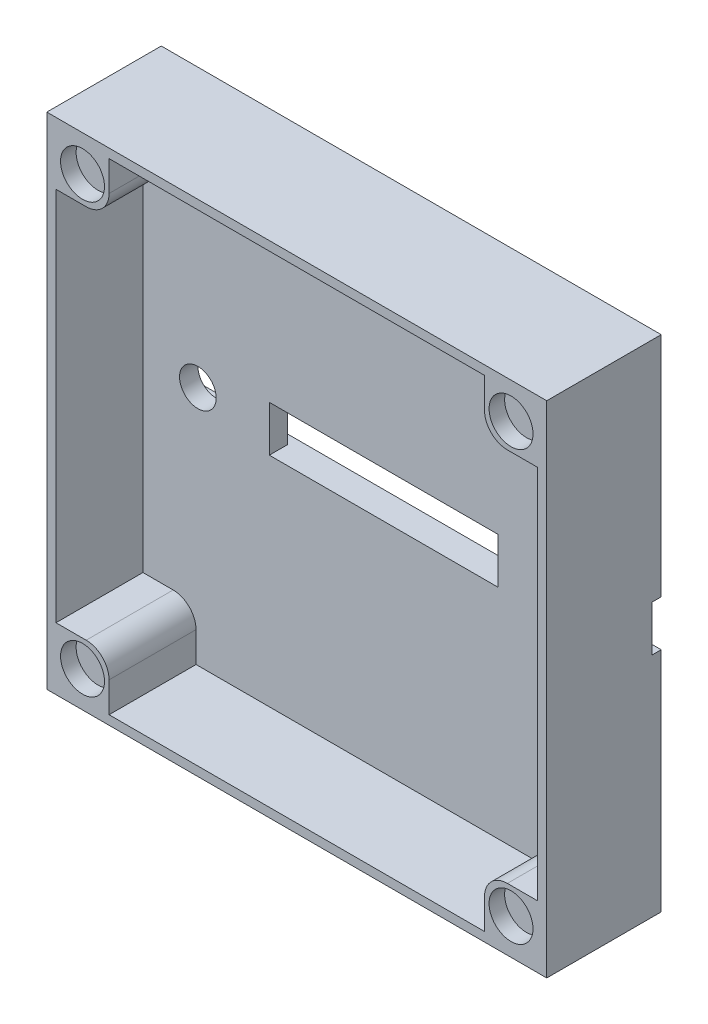
ISO-10303-21;
HEADER;
FILE_DESCRIPTION(('STEP AP214'),'2;1');
FILE_NAME('part.step','',(''),(''),'','','');
FILE_SCHEMA(('AUTOMOTIVE_DESIGN { 1 0 10303 214 1 1 1 1 }'));
ENDSEC;
DATA;
#1=APPLICATION_CONTEXT('core data for automotive mechanical design processes');
#2=APPLICATION_PROTOCOL_DEFINITION('international standard','automotive_design',2000,#1);
#3=PRODUCT_CONTEXT('',#1,'mechanical');
#4=PRODUCT('Part','Part','',(#3));
#5=PRODUCT_RELATED_PRODUCT_CATEGORY('part','',(#4));
#6=PRODUCT_DEFINITION_FORMATION('','',#4);
#7=PRODUCT_DEFINITION_CONTEXT('part definition',#1,'design');
#8=PRODUCT_DEFINITION('design','',#6,#7);
#9=PRODUCT_DEFINITION_SHAPE('','',#8);
#10=(LENGTH_UNIT() NAMED_UNIT(*) SI_UNIT(.MILLI.,.METRE.));
#11=(NAMED_UNIT(*) PLANE_ANGLE_UNIT() SI_UNIT($,.RADIAN.));
#12=(NAMED_UNIT(*) SI_UNIT($,.STERADIAN.) SOLID_ANGLE_UNIT());
#13=UNCERTAINTY_MEASURE_WITH_UNIT(LENGTH_MEASURE(1.E-05),#10,'distance_accuracy_value','');
#14=(GEOMETRIC_REPRESENTATION_CONTEXT(3) GLOBAL_UNCERTAINTY_ASSIGNED_CONTEXT((#13)) GLOBAL_UNIT_ASSIGNED_CONTEXT((#10,
#11,#12)) REPRESENTATION_CONTEXT('',''));
#15=CARTESIAN_POINT('',(0.,0.,0.));
#16=DIRECTION('',(0.,0.,1.));
#17=DIRECTION('',(1.,0.,0.));
#18=AXIS2_PLACEMENT_3D('',#15,#16,#17);
#19=CARTESIAN_POINT('',(0.,0.,3.));
#20=DIRECTION('',(0.,0.,1.));
#21=DIRECTION('',(1.,0.,0.));
#22=AXIS2_PLACEMENT_3D('',#19,#20,#21);
#23=PLANE('',#22);
#24=DIRECTION('',(0.,1.,0.));
#25=VECTOR('',#24,1.);
#26=CARTESIAN_POINT('',(-20.5,0.,3.));
#27=LINE('',#26,#25);
#28=CARTESIAN_POINT('',(-20.5,-26.3,3.));
#29=VERTEX_POINT('',#28);
#30=CARTESIAN_POINT('',(-20.5,-23.,3.));
#31=VERTEX_POINT('',#30);
#32=EDGE_CURVE('E265',#29,#31,#27,.T.);
#33=ORIENTED_EDGE('',*,*,#32,.F.);
#34=DIRECTION('',(1.,0.,0.));
#35=VECTOR('',#34,1.);
#36=CARTESIAN_POINT('',(-26.3,-26.3,3.));
#37=LINE('',#36,#35);
#38=CARTESIAN_POINT('',(20.5,-26.3,3.));
#39=VERTEX_POINT('',#38);
#40=EDGE_CURVE('E279',#29,#39,#37,.T.);
#41=ORIENTED_EDGE('',*,*,#40,.T.);
#42=DIRECTION('',(0.,-1.,0.));
#43=VECTOR('',#42,1.);
#44=CARTESIAN_POINT('',(20.5,0.,3.));
#45=LINE('',#44,#43);
#46=CARTESIAN_POINT('',(20.5,-23.,3.));
#47=VERTEX_POINT('',#46);
#48=EDGE_CURVE('E347',#47,#39,#45,.T.);
#49=ORIENTED_EDGE('',*,*,#48,.F.);
#50=CARTESIAN_POINT('',(23.,-23.,3.));
#51=DIRECTION('',(0.,0.,1.));
#52=DIRECTION('',(1.,0.,0.));
#53=AXIS2_PLACEMENT_3D('',#50,#51,#52);
#54=CIRCLE('',#53,2.5);
#55=CARTESIAN_POINT('',(23.,-20.5,3.));
#56=VERTEX_POINT('',#55);
#57=EDGE_CURVE('E318',#47,#56,#54,.F.);
#58=ORIENTED_EDGE('',*,*,#57,.T.);
#59=DIRECTION('',(-1.,0.,0.));
#60=VECTOR('',#59,1.);
#61=CARTESIAN_POINT('',(0.,-20.5,3.));
#62=LINE('',#61,#60);
#63=CARTESIAN_POINT('',(26.3,-20.5,3.));
#64=VERTEX_POINT('',#63);
#65=EDGE_CURVE('E352',#64,#56,#62,.T.);
#66=ORIENTED_EDGE('',*,*,#65,.F.);
#67=DIRECTION('',(0.,-1.,0.));
#68=VECTOR('',#67,1.);
#69=CARTESIAN_POINT('',(26.3,0.,3.));
#70=LINE('',#69,#68);
#71=CARTESIAN_POINT('',(26.3,20.5,3.));
#72=VERTEX_POINT('',#71);
#73=EDGE_CURVE('E416',#72,#64,#70,.T.);
#74=ORIENTED_EDGE('',*,*,#73,.F.);
#75=DIRECTION('',(1.,0.,0.));
#76=VECTOR('',#75,1.);
#77=CARTESIAN_POINT('',(0.,20.5,3.));
#78=LINE('',#77,#76);
#79=CARTESIAN_POINT('',(23.,20.5,3.));
#80=VERTEX_POINT('',#79);
#81=EDGE_CURVE('E377',#80,#72,#78,.T.);
#82=ORIENTED_EDGE('',*,*,#81,.F.);
#83=CARTESIAN_POINT('',(23.,23.,3.));
#84=DIRECTION('',(0.,0.,1.));
#85=DIRECTION('',(1.,0.,0.));
#86=AXIS2_PLACEMENT_3D('',#83,#84,#85);
#87=CIRCLE('',#86,2.5);
#88=CARTESIAN_POINT('',(20.5,23.,3.));
#89=VERTEX_POINT('',#88);
#90=EDGE_CURVE('E316',#80,#89,#87,.F.);
#91=ORIENTED_EDGE('',*,*,#90,.T.);
#92=DIRECTION('',(0.,-1.,0.));
#93=VECTOR('',#92,1.);
#94=CARTESIAN_POINT('',(20.5,0.,3.));
#95=LINE('',#94,#93);
#96=CARTESIAN_POINT('',(20.5,26.3,3.));
#97=VERTEX_POINT('',#96);
#98=EDGE_CURVE('E382',#97,#89,#95,.T.);
#99=ORIENTED_EDGE('',*,*,#98,.F.);
#100=DIRECTION('',(1.,0.,0.));
#101=VECTOR('',#100,1.);
#102=CARTESIAN_POINT('',(0.,26.3,3.));
#103=LINE('',#102,#101);
#104=CARTESIAN_POINT('',(-20.5,26.3,3.));
#105=VERTEX_POINT('',#104);
#106=EDGE_CURVE('E278',#105,#97,#103,.T.);
#107=ORIENTED_EDGE('',*,*,#106,.F.);
#108=DIRECTION('',(0.,1.,0.));
#109=VECTOR('',#108,1.);
#110=CARTESIAN_POINT('',(-20.5,0.,3.));
#111=LINE('',#110,#109);
#112=CARTESIAN_POINT('',(-20.5,23.,3.));
#113=VERTEX_POINT('',#112);
#114=EDGE_CURVE('E363',#113,#105,#111,.T.);
#115=ORIENTED_EDGE('',*,*,#114,.F.);
#116=CARTESIAN_POINT('',(-23.,23.,3.));
#117=DIRECTION('',(0.,0.,1.));
#118=DIRECTION('',(1.,0.,0.));
#119=AXIS2_PLACEMENT_3D('',#116,#117,#118);
#120=CIRCLE('',#119,2.5);
#121=CARTESIAN_POINT('',(-23.,20.5,3.));
#122=VERTEX_POINT('',#121);
#123=EDGE_CURVE('E12',#113,#122,#120,.F.);
#124=ORIENTED_EDGE('',*,*,#123,.T.);
#125=DIRECTION('',(1.,0.,0.));
#126=VECTOR('',#125,1.);
#127=CARTESIAN_POINT('',(0.,20.5,3.));
#128=LINE('',#127,#126);
#129=CARTESIAN_POINT('',(-26.3,20.5,3.));
#130=VERTEX_POINT('',#129);
#131=EDGE_CURVE('E367',#130,#122,#128,.T.);
#132=ORIENTED_EDGE('',*,*,#131,.F.);
#133=DIRECTION('',(0.,-1.,0.));
#134=VECTOR('',#133,1.);
#135=CARTESIAN_POINT('',(-26.3,0.,3.));
#136=LINE('',#135,#134);
#137=CARTESIAN_POINT('',(-26.3,-20.5,3.));
#138=VERTEX_POINT('',#137);
#139=EDGE_CURVE('E401',#130,#138,#136,.T.);
#140=ORIENTED_EDGE('',*,*,#139,.T.);
#141=DIRECTION('',(-1.,0.,0.));
#142=VECTOR('',#141,1.);
#143=CARTESIAN_POINT('',(0.,-20.5,3.));
#144=LINE('',#143,#142);
#145=CARTESIAN_POINT('',(-23.,-20.5,3.));
#146=VERTEX_POINT('',#145);
#147=EDGE_CURVE('E322',#146,#138,#144,.T.);
#148=ORIENTED_EDGE('',*,*,#147,.F.);
#149=CARTESIAN_POINT('',(-23.,-23.,3.));
#150=DIRECTION('',(0.,0.,1.));
#151=DIRECTION('',(1.,0.,0.));
#152=AXIS2_PLACEMENT_3D('',#149,#150,#151);
#153=CIRCLE('',#152,2.5);
#154=EDGE_CURVE('E79',#146,#31,#153,.F.);
#155=ORIENTED_EDGE('',*,*,#154,.T.);
#156=EDGE_LOOP('',(#33,#41,#49,#58,#66,#74,#82,#91,#99,#107,#115,#124,#132,#140,#148,#155));
#157=FACE_BOUND('',#156,.T.);
#158=CARTESIAN_POINT('',(20.3,0.,3.));
#159=DIRECTION('',(0.,0.,1.));
#160=DIRECTION('',(1.,0.,0.));
#161=AXIS2_PLACEMENT_3D('',#158,#159,#160);
#162=CIRCLE('',#161,2.);
#163=CARTESIAN_POINT('',(22.3,0.,3.));
#164=VERTEX_POINT('',#163);
#165=EDGE_CURVE('E394',#164,#164,#162,.T.);
#166=ORIENTED_EDGE('',*,*,#165,.F.);
#167=EDGE_LOOP('',(#166));
#168=FACE_BOUND('',#167,.T.);
#169=CARTESIAN_POINT('',(-20.3,0.,3.));
#170=DIRECTION('',(0.,0.,1.));
#171=DIRECTION('',(1.,0.,0.));
#172=AXIS2_PLACEMENT_3D('',#169,#170,#171);
#173=CIRCLE('',#172,2.);
#174=CARTESIAN_POINT('',(-18.3,0.,3.));
#175=VERTEX_POINT('',#174);
#176=EDGE_CURVE('E389',#175,#175,#173,.T.);
#177=ORIENTED_EDGE('',*,*,#176,.F.);
#178=EDGE_LOOP('',(#177));
#179=FACE_BOUND('',#178,.T.);
#180=DIRECTION('',(0.,1.,0.));
#181=VECTOR('',#180,1.);
#182=CARTESIAN_POINT('',(12.5,2.5,3.));
#183=LINE('',#182,#181);
#184=CARTESIAN_POINT('',(12.5,-2.5,3.));
#185=VERTEX_POINT('',#184);
#186=CARTESIAN_POINT('',(12.5,2.5,3.));
#187=VERTEX_POINT('',#186);
#188=EDGE_CURVE('E442',#185,#187,#183,.T.);
#189=ORIENTED_EDGE('',*,*,#188,.F.);
#190=DIRECTION('',(1.,0.,0.));
#191=VECTOR('',#190,1.);
#192=CARTESIAN_POINT('',(-12.5,-2.5,3.));
#193=LINE('',#192,#191);
#194=CARTESIAN_POINT('',(-12.5,-2.5,3.));
#195=VERTEX_POINT('',#194);
#196=EDGE_CURVE('E453',#195,#185,#193,.T.);
#197=ORIENTED_EDGE('',*,*,#196,.F.);
#198=DIRECTION('',(0.,-1.,0.));
#199=VECTOR('',#198,1.);
#200=CARTESIAN_POINT('',(-12.5,2.5,3.));
#201=LINE('',#200,#199);
#202=CARTESIAN_POINT('',(-12.5,2.5,3.));
#203=VERTEX_POINT('',#202);
#204=EDGE_CURVE('E460',#203,#195,#201,.T.);
#205=ORIENTED_EDGE('',*,*,#204,.F.);
#206=DIRECTION('',(-1.,0.,0.));
#207=VECTOR('',#206,1.);
#208=CARTESIAN_POINT('',(-12.5,2.5,3.));
#209=LINE('',#208,#207);
#210=EDGE_CURVE('E457',#187,#203,#209,.T.);
#211=ORIENTED_EDGE('',*,*,#210,.F.);
#212=EDGE_LOOP('',(#189,#197,#205,#211));
#213=FACE_BOUND('',#212,.T.);
#214=ADVANCED_FACE('F71',(#157,#168,#179,#213),#23,.T.);
#215=CARTESIAN_POINT('',(27.3,27.3,3.));
#216=DIRECTION('',(1.,0.,0.));
#217=DIRECTION('',(0.,1.,0.));
#218=AXIS2_PLACEMENT_3D('',#215,#216,#217);
#219=PLANE('',#218);
#220=DIRECTION('',(0.,0.,-1.));
#221=VECTOR('',#220,1.);
#222=CARTESIAN_POINT('',(27.3,27.3,3.));
#223=LINE('',#222,#221);
#224=CARTESIAN_POINT('',(27.3,27.3,12.5));
#225=VERTEX_POINT('',#224);
#226=CARTESIAN_POINT('',(27.3,27.3,0.));
#227=VERTEX_POINT('',#226);
#228=EDGE_CURVE('E486',#225,#227,#223,.T.);
#229=ORIENTED_EDGE('',*,*,#228,.F.);
#230=DIRECTION('',(0.,1.,0.));
#231=VECTOR('',#230,1.);
#232=CARTESIAN_POINT('',(27.3,0.,12.5));
#233=LINE('',#232,#231);
#234=CARTESIAN_POINT('',(27.3,-27.3,12.5));
#235=VERTEX_POINT('',#234);
#236=EDGE_CURVE('E406',#235,#225,#233,.T.);
#237=ORIENTED_EDGE('',*,*,#236,.F.);
#238=DIRECTION('',(0.,0.,-1.));
#239=VECTOR('',#238,1.);
#240=CARTESIAN_POINT('',(27.3,-27.3,3.));
#241=LINE('',#240,#239);
#242=CARTESIAN_POINT('',(27.3,-27.3,0.));
#243=VERTEX_POINT('',#242);
#244=EDGE_CURVE('E290',#235,#243,#241,.T.);
#245=ORIENTED_EDGE('',*,*,#244,.T.);
#246=DIRECTION('',(0.,-1.,0.));
#247=VECTOR('',#246,1.);
#248=CARTESIAN_POINT('',(27.3,27.3,0.));
#249=LINE('',#248,#247);
#250=CARTESIAN_POINT('',(27.3,-2.5,0.));
#251=VERTEX_POINT('',#250);
#252=EDGE_CURVE('E480',#251,#243,#249,.T.);
#253=ORIENTED_EDGE('',*,*,#252,.F.);
#254=DIRECTION('',(0.,0.,-1.));
#255=VECTOR('',#254,1.);
#256=CARTESIAN_POINT('',(27.3,-2.5,1.));
#257=LINE('',#256,#255);
#258=CARTESIAN_POINT('',(27.3,-2.5,1.));
#259=VERTEX_POINT('',#258);
#260=EDGE_CURVE('E435',#259,#251,#257,.T.);
#261=ORIENTED_EDGE('',*,*,#260,.F.);
#262=DIRECTION('',(0.,-1.,0.));
#263=VECTOR('',#262,1.);
#264=CARTESIAN_POINT('',(27.3,2.5,1.));
#265=LINE('',#264,#263);
#266=CARTESIAN_POINT('',(27.3,2.5,1.));
#267=VERTEX_POINT('',#266);
#268=EDGE_CURVE('E421',#267,#259,#265,.T.);
#269=ORIENTED_EDGE('',*,*,#268,.F.);
#270=DIRECTION('',(0.,0.,-1.));
#271=VECTOR('',#270,1.);
#272=CARTESIAN_POINT('',(27.3,2.5,1.));
#273=LINE('',#272,#271);
#274=CARTESIAN_POINT('',(27.3,2.5,0.));
#275=VERTEX_POINT('',#274);
#276=EDGE_CURVE('E439',#267,#275,#273,.T.);
#277=ORIENTED_EDGE('',*,*,#276,.T.);
#278=EDGE_CURVE('E481',#227,#275,#249,.T.);
#279=ORIENTED_EDGE('',*,*,#278,.F.);
#280=EDGE_LOOP('',(#229,#237,#245,#253,#261,#269,#277,#279));
#281=FACE_BOUND('',#280,.T.);
#282=ADVANCED_FACE('F511',(#281),#219,.T.);
#283=CARTESIAN_POINT('',(-27.3,27.3,3.));
#284=DIRECTION('',(1.,0.,0.));
#285=DIRECTION('',(0.,1.,0.));
#286=AXIS2_PLACEMENT_3D('',#283,#284,#285);
#287=PLANE('',#286);
#288=DIRECTION('',(0.,-1.,0.));
#289=VECTOR('',#288,1.);
#290=CARTESIAN_POINT('',(-27.3,27.3,0.));
#291=LINE('',#290,#289);
#292=CARTESIAN_POINT('',(-27.3,-2.5,0.));
#293=VERTEX_POINT('',#292);
#294=CARTESIAN_POINT('',(-27.3,-27.3,0.));
#295=VERTEX_POINT('',#294);
#296=EDGE_CURVE('E475',#293,#295,#291,.T.);
#297=ORIENTED_EDGE('',*,*,#296,.T.);
#298=DIRECTION('',(0.,0.,-1.));
#299=VECTOR('',#298,1.);
#300=CARTESIAN_POINT('',(-27.3,-27.3,3.));
#301=LINE('',#300,#299);
#302=CARTESIAN_POINT('',(-27.3,-27.3,12.5));
#303=VERTEX_POINT('',#302);
#304=EDGE_CURVE('E483',#303,#295,#301,.T.);
#305=ORIENTED_EDGE('',*,*,#304,.F.);
#306=DIRECTION('',(0.,-1.,0.));
#307=VECTOR('',#306,1.);
#308=CARTESIAN_POINT('',(-27.3,0.,12.5));
#309=LINE('',#308,#307);
#310=CARTESIAN_POINT('',(-27.3,27.3,12.5));
#311=VERTEX_POINT('',#310);
#312=EDGE_CURVE('E410',#311,#303,#309,.T.);
#313=ORIENTED_EDGE('',*,*,#312,.F.);
#314=DIRECTION('',(0.,0.,-1.));
#315=VECTOR('',#314,1.);
#316=CARTESIAN_POINT('',(-27.3,27.3,3.));
#317=LINE('',#316,#315);
#318=CARTESIAN_POINT('',(-27.3,27.3,0.));
#319=VERTEX_POINT('',#318);
#320=EDGE_CURVE('E488',#311,#319,#317,.T.);
#321=ORIENTED_EDGE('',*,*,#320,.T.);
#322=CARTESIAN_POINT('',(-27.3,2.5,0.));
#323=VERTEX_POINT('',#322);
#324=EDGE_CURVE('E476',#319,#323,#291,.T.);
#325=ORIENTED_EDGE('',*,*,#324,.T.);
#326=DIRECTION('',(0.,0.,-1.));
#327=VECTOR('',#326,1.);
#328=CARTESIAN_POINT('',(-27.3,2.5,1.));
#329=LINE('',#328,#327);
#330=CARTESIAN_POINT('',(-27.3,2.5,1.));
#331=VERTEX_POINT('',#330);
#332=EDGE_CURVE('E443',#331,#323,#329,.T.);
#333=ORIENTED_EDGE('',*,*,#332,.F.);
#334=DIRECTION('',(0.,-1.,0.));
#335=VECTOR('',#334,1.);
#336=CARTESIAN_POINT('',(-27.3,2.5,1.));
#337=LINE('',#336,#335);
#338=CARTESIAN_POINT('',(-27.3,-2.5,1.));
#339=VERTEX_POINT('',#338);
#340=EDGE_CURVE('E428',#331,#339,#337,.T.);
#341=ORIENTED_EDGE('',*,*,#340,.T.);
#342=DIRECTION('',(0.,0.,-1.));
#343=VECTOR('',#342,1.);
#344=CARTESIAN_POINT('',(-27.3,-2.5,1.));
#345=LINE('',#344,#343);
#346=EDGE_CURVE('E446',#339,#293,#345,.T.);
#347=ORIENTED_EDGE('',*,*,#346,.T.);
#348=EDGE_LOOP('',(#297,#305,#313,#321,#325,#333,#341,#347));
#349=FACE_BOUND('',#348,.T.);
#350=ADVANCED_FACE('F500',(#349),#287,.F.);
#351=CARTESIAN_POINT('',(0.,0.,0.));
#352=DIRECTION('',(0.,0.,1.));
#353=DIRECTION('',(1.,0.,0.));
#354=AXIS2_PLACEMENT_3D('',#351,#352,#353);
#355=PLANE('',#354);
#356=DIRECTION('',(-1.,0.,0.));
#357=VECTOR('',#356,1.);
#358=CARTESIAN_POINT('',(27.3,2.5,0.));
#359=LINE('',#358,#357);
#360=EDGE_CURVE('E425',#275,#323,#359,.T.);
#361=ORIENTED_EDGE('',*,*,#360,.T.);
#362=ORIENTED_EDGE('',*,*,#324,.F.);
#363=DIRECTION('',(-1.,0.,0.));
#364=VECTOR('',#363,1.);
#365=CARTESIAN_POINT('',(27.3,27.3,0.));
#366=LINE('',#365,#364);
#367=EDGE_CURVE('E478',#227,#319,#366,.T.);
#368=ORIENTED_EDGE('',*,*,#367,.F.);
#369=ORIENTED_EDGE('',*,*,#278,.T.);
#370=EDGE_LOOP('',(#361,#362,#368,#369));
#371=FACE_BOUND('',#370,.T.);
#372=ADVANCED_FACE('F521',(#371),#355,.F.);
#373=CARTESIAN_POINT('',(27.3,-27.3,3.));
#374=DIRECTION('',(0.,-1.,0.));
#375=DIRECTION('',(1.,0.,0.));
#376=AXIS2_PLACEMENT_3D('',#373,#374,#375);
#377=PLANE('',#376);
#378=ORIENTED_EDGE('',*,*,#244,.F.);
#379=DIRECTION('',(1.,0.,0.));
#380=VECTOR('',#379,1.);
#381=CARTESIAN_POINT('',(0.,-27.3,12.5));
#382=LINE('',#381,#380);
#383=EDGE_CURVE('E404',#303,#235,#382,.T.);
#384=ORIENTED_EDGE('',*,*,#383,.F.);
#385=ORIENTED_EDGE('',*,*,#304,.T.);
#386=DIRECTION('',(-1.,0.,0.));
#387=VECTOR('',#386,1.);
#388=CARTESIAN_POINT('',(27.3,-27.3,0.));
#389=LINE('',#388,#387);
#390=EDGE_CURVE('E467',#243,#295,#389,.T.);
#391=ORIENTED_EDGE('',*,*,#390,.F.);
#392=EDGE_LOOP('',(#378,#384,#385,#391));
#393=FACE_BOUND('',#392,.T.);
#394=ADVANCED_FACE('F496',(#393),#377,.T.);
#395=CARTESIAN_POINT('',(27.3,27.3,3.));
#396=DIRECTION('',(0.,-1.,0.));
#397=DIRECTION('',(1.,0.,0.));
#398=AXIS2_PLACEMENT_3D('',#395,#396,#397);
#399=PLANE('',#398);
#400=ORIENTED_EDGE('',*,*,#367,.T.);
#401=ORIENTED_EDGE('',*,*,#320,.F.);
#402=DIRECTION('',(-1.,0.,0.));
#403=VECTOR('',#402,1.);
#404=CARTESIAN_POINT('',(0.,27.3,12.5));
#405=LINE('',#404,#403);
#406=EDGE_CURVE('E408',#225,#311,#405,.T.);
#407=ORIENTED_EDGE('',*,*,#406,.F.);
#408=ORIENTED_EDGE('',*,*,#228,.T.);
#409=EDGE_LOOP('',(#400,#401,#407,#408));
#410=FACE_BOUND('',#409,.T.);
#411=ADVANCED_FACE('F516',(#410),#399,.F.);
#412=ORIENTED_EDGE('',*,*,#390,.T.);
#413=ORIENTED_EDGE('',*,*,#296,.F.);
#414=DIRECTION('',(-1.,0.,0.));
#415=VECTOR('',#414,1.);
#416=CARTESIAN_POINT('',(27.3,-2.5,0.));
#417=LINE('',#416,#415);
#418=EDGE_CURVE('E414',#251,#293,#417,.T.);
#419=ORIENTED_EDGE('',*,*,#418,.F.);
#420=ORIENTED_EDGE('',*,*,#252,.T.);
#421=EDGE_LOOP('',(#412,#413,#419,#420));
#422=FACE_BOUND('',#421,.T.);
#423=ADVANCED_FACE('F505',(#422),#355,.F.);
#424=CARTESIAN_POINT('',(12.5,2.5,1.));
#425=DIRECTION('',(1.,0.,0.));
#426=DIRECTION('',(0.,1.,0.));
#427=AXIS2_PLACEMENT_3D('',#424,#425,#426);
#428=PLANE('',#427);
#429=ORIENTED_EDGE('',*,*,#188,.T.);
#430=DIRECTION('',(0.,0.,1.));
#431=VECTOR('',#430,1.);
#432=CARTESIAN_POINT('',(12.5,2.5,1.));
#433=LINE('',#432,#431);
#434=CARTESIAN_POINT('',(12.5,2.5,1.));
#435=VERTEX_POINT('',#434);
#436=EDGE_CURVE('E455',#435,#187,#433,.T.);
#437=ORIENTED_EDGE('',*,*,#436,.F.);
#438=DIRECTION('',(0.,1.,0.));
#439=VECTOR('',#438,1.);
#440=CARTESIAN_POINT('',(12.5,2.5,1.));
#441=LINE('',#440,#439);
#442=CARTESIAN_POINT('',(12.5,-2.5,1.));
#443=VERTEX_POINT('',#442);
#444=EDGE_CURVE('E450',#443,#435,#441,.T.);
#445=ORIENTED_EDGE('',*,*,#444,.F.);
#446=DIRECTION('',(0.,0.,1.));
#447=VECTOR('',#446,1.);
#448=CARTESIAN_POINT('',(12.5,-2.5,1.));
#449=LINE('',#448,#447);
#450=EDGE_CURVE('E465',#443,#185,#449,.T.);
#451=ORIENTED_EDGE('',*,*,#450,.T.);
#452=EDGE_LOOP('',(#429,#437,#445,#451));
#453=FACE_BOUND('',#452,.T.);
#454=ADVANCED_FACE('F534',(#453),#428,.F.);
#455=CARTESIAN_POINT('',(-12.5,-2.5,1.));
#456=DIRECTION('',(0.,-1.,0.));
#457=DIRECTION('',(0.,0.,-1.));
#458=AXIS2_PLACEMENT_3D('',#455,#456,#457);
#459=PLANE('',#458);
#460=ORIENTED_EDGE('',*,*,#196,.T.);
#461=ORIENTED_EDGE('',*,*,#450,.F.);
#462=DIRECTION('',(-1.,0.,0.));
#463=VECTOR('',#462,1.);
#464=CARTESIAN_POINT('',(27.3,-2.5,1.));
#465=LINE('',#464,#463);
#466=EDGE_CURVE('E426',#259,#443,#465,.T.);
#467=ORIENTED_EDGE('',*,*,#466,.F.);
#468=ORIENTED_EDGE('',*,*,#260,.T.);
#469=ORIENTED_EDGE('',*,*,#418,.T.);
#470=ORIENTED_EDGE('',*,*,#346,.F.);
#471=CARTESIAN_POINT('',(-12.5,-2.5,1.));
#472=VERTEX_POINT('',#471);
#473=EDGE_CURVE('E424',#472,#339,#465,.T.);
#474=ORIENTED_EDGE('',*,*,#473,.F.);
#475=DIRECTION('',(0.,0.,1.));
#476=VECTOR('',#475,1.);
#477=CARTESIAN_POINT('',(-12.5,-2.5,1.));
#478=LINE('',#477,#476);
#479=EDGE_CURVE('E468',#472,#195,#478,.T.);
#480=ORIENTED_EDGE('',*,*,#479,.T.);
#481=EDGE_LOOP('',(#460,#461,#467,#468,#469,#470,#474,#480));
#482=FACE_BOUND('',#481,.T.);
#483=ADVANCED_FACE('F549',(#482),#459,.F.);
#484=CARTESIAN_POINT('',(-12.5,2.5,1.));
#485=DIRECTION('',(-1.,0.,0.));
#486=DIRECTION('',(0.,0.,1.));
#487=AXIS2_PLACEMENT_3D('',#484,#485,#486);
#488=PLANE('',#487);
#489=ORIENTED_EDGE('',*,*,#204,.T.);
#490=ORIENTED_EDGE('',*,*,#479,.F.);
#491=DIRECTION('',(0.,-1.,0.));
#492=VECTOR('',#491,1.);
#493=CARTESIAN_POINT('',(-12.5,2.5,1.));
#494=LINE('',#493,#492);
#495=CARTESIAN_POINT('',(-12.5,2.5,1.));
#496=VERTEX_POINT('',#495);
#497=EDGE_CURVE('E452',#496,#472,#494,.T.);
#498=ORIENTED_EDGE('',*,*,#497,.F.);
#499=DIRECTION('',(0.,0.,1.));
#500=VECTOR('',#499,1.);
#501=CARTESIAN_POINT('',(-12.5,2.5,1.));
#502=LINE('',#501,#500);
#503=EDGE_CURVE('E470',#496,#203,#502,.T.);
#504=ORIENTED_EDGE('',*,*,#503,.T.);
#505=EDGE_LOOP('',(#489,#490,#498,#504));
#506=FACE_BOUND('',#505,.T.);
#507=ADVANCED_FACE('F544',(#506),#488,.F.);
#508=CARTESIAN_POINT('',(-12.5,2.5,1.));
#509=DIRECTION('',(0.,1.,0.));
#510=DIRECTION('',(-1.,0.,0.));
#511=AXIS2_PLACEMENT_3D('',#508,#509,#510);
#512=PLANE('',#511);
#513=ORIENTED_EDGE('',*,*,#210,.T.);
#514=ORIENTED_EDGE('',*,*,#503,.F.);
#515=DIRECTION('',(-1.,0.,0.));
#516=VECTOR('',#515,1.);
#517=CARTESIAN_POINT('',(27.3,2.5,1.));
#518=LINE('',#517,#516);
#519=EDGE_CURVE('E431',#496,#331,#518,.T.);
#520=ORIENTED_EDGE('',*,*,#519,.T.);
#521=ORIENTED_EDGE('',*,*,#332,.T.);
#522=ORIENTED_EDGE('',*,*,#360,.F.);
#523=ORIENTED_EDGE('',*,*,#276,.F.);
#524=EDGE_CURVE('E432',#267,#435,#518,.T.);
#525=ORIENTED_EDGE('',*,*,#524,.T.);
#526=ORIENTED_EDGE('',*,*,#436,.T.);
#527=EDGE_LOOP('',(#513,#514,#520,#521,#522,#523,#525,#526));
#528=FACE_BOUND('',#527,.T.);
#529=ADVANCED_FACE('F524',(#528),#512,.F.);
#530=CARTESIAN_POINT('',(0.,0.,1.));
#531=DIRECTION('',(0.,0.,-1.));
#532=DIRECTION('',(-1.,0.,0.));
#533=AXIS2_PLACEMENT_3D('',#530,#531,#532);
#534=PLANE('',#533);
#535=CARTESIAN_POINT('',(20.3,0.,1.));
#536=DIRECTION('',(0.,0.,-1.));
#537=DIRECTION('',(-1.,0.,0.));
#538=AXIS2_PLACEMENT_3D('',#535,#536,#537);
#539=CIRCLE('',#538,2.);
#540=CARTESIAN_POINT('',(18.3,0.,1.));
#541=VERTEX_POINT('',#540);
#542=EDGE_CURVE('E386',#541,#541,#539,.T.);
#543=ORIENTED_EDGE('',*,*,#542,.F.);
#544=EDGE_LOOP('',(#543));
#545=FACE_BOUND('',#544,.T.);
#546=ORIENTED_EDGE('',*,*,#444,.T.);
#547=ORIENTED_EDGE('',*,*,#524,.F.);
#548=ORIENTED_EDGE('',*,*,#268,.T.);
#549=ORIENTED_EDGE('',*,*,#466,.T.);
#550=EDGE_LOOP('',(#546,#547,#548,#549));
#551=FACE_BOUND('',#550,.T.);
#552=ADVANCED_FACE('F528',(#545,#551),#534,.T.);
#553=CARTESIAN_POINT('',(-20.3,0.,1.));
#554=DIRECTION('',(0.,0.,-1.));
#555=DIRECTION('',(-1.,0.,0.));
#556=AXIS2_PLACEMENT_3D('',#553,#554,#555);
#557=CIRCLE('',#556,2.);
#558=CARTESIAN_POINT('',(-22.3,0.,1.));
#559=VERTEX_POINT('',#558);
#560=EDGE_CURVE('E385',#559,#559,#557,.T.);
#561=ORIENTED_EDGE('',*,*,#560,.F.);
#562=EDGE_LOOP('',(#561));
#563=FACE_BOUND('',#562,.T.);
#564=ORIENTED_EDGE('',*,*,#497,.T.);
#565=ORIENTED_EDGE('',*,*,#473,.T.);
#566=ORIENTED_EDGE('',*,*,#340,.F.);
#567=ORIENTED_EDGE('',*,*,#519,.F.);
#568=EDGE_LOOP('',(#564,#565,#566,#567));
#569=FACE_BOUND('',#568,.T.);
#570=ADVANCED_FACE('F547',(#563,#569),#534,.T.);
#571=CARTESIAN_POINT('',(26.3,0.,12.5));
#572=DIRECTION('',(1.,0.,0.));
#573=DIRECTION('',(0.,1.,0.));
#574=AXIS2_PLACEMENT_3D('',#571,#572,#573);
#575=PLANE('',#574);
#576=ORIENTED_EDGE('',*,*,#73,.T.);
#577=DIRECTION('',(0.,0.,1.));
#578=VECTOR('',#577,1.);
#579=CARTESIAN_POINT('',(26.3,-20.5,12.5));
#580=LINE('',#579,#578);
#581=CARTESIAN_POINT('',(26.3,-20.5,12.5));
#582=VERTEX_POINT('',#581);
#583=EDGE_CURVE('E349',#64,#582,#580,.T.);
#584=ORIENTED_EDGE('',*,*,#583,.T.);
#585=DIRECTION('',(0.,-1.,0.));
#586=VECTOR('',#585,1.);
#587=CARTESIAN_POINT('',(26.3,0.,12.5));
#588=LINE('',#587,#586);
#589=CARTESIAN_POINT('',(26.3,20.5,12.5));
#590=VERTEX_POINT('',#589);
#591=EDGE_CURVE('E400',#590,#582,#588,.T.);
#592=ORIENTED_EDGE('',*,*,#591,.F.);
#593=DIRECTION('',(0.,0.,-1.));
#594=VECTOR('',#593,1.);
#595=CARTESIAN_POINT('',(26.3,20.5,12.5));
#596=LINE('',#595,#594);
#597=EDGE_CURVE('E374',#590,#72,#596,.T.);
#598=ORIENTED_EDGE('',*,*,#597,.T.);
#599=EDGE_LOOP('',(#576,#584,#592,#598));
#600=FACE_BOUND('',#599,.T.);
#601=ADVANCED_FACE('F611',(#600),#575,.F.);
#602=CARTESIAN_POINT('',(-26.3,0.,12.5));
#603=DIRECTION('',(1.,0.,0.));
#604=DIRECTION('',(0.,1.,0.));
#605=AXIS2_PLACEMENT_3D('',#602,#603,#604);
#606=PLANE('',#605);
#607=DIRECTION('',(0.,0.,1.));
#608=VECTOR('',#607,1.);
#609=CARTESIAN_POINT('',(-26.3,-20.5,12.5));
#610=LINE('',#609,#608);
#611=CARTESIAN_POINT('',(-26.3,-20.5,12.5));
#612=VERTEX_POINT('',#611);
#613=EDGE_CURVE('E325',#138,#612,#610,.T.);
#614=ORIENTED_EDGE('',*,*,#613,.F.);
#615=ORIENTED_EDGE('',*,*,#139,.F.);
#616=DIRECTION('',(0.,0.,-1.));
#617=VECTOR('',#616,1.);
#618=CARTESIAN_POINT('',(-26.3,20.5,12.5));
#619=LINE('',#618,#617);
#620=CARTESIAN_POINT('',(-26.3,20.5,12.5));
#621=VERTEX_POINT('',#620);
#622=EDGE_CURVE('E365',#621,#130,#619,.T.);
#623=ORIENTED_EDGE('',*,*,#622,.F.);
#624=DIRECTION('',(0.,-1.,0.));
#625=VECTOR('',#624,1.);
#626=CARTESIAN_POINT('',(-26.3,0.,12.5));
#627=LINE('',#626,#625);
#628=EDGE_CURVE('E412',#621,#612,#627,.T.);
#629=ORIENTED_EDGE('',*,*,#628,.T.);
#630=EDGE_LOOP('',(#614,#615,#623,#629));
#631=FACE_BOUND('',#630,.T.);
#632=ADVANCED_FACE('F654',(#631),#606,.T.);
#633=CARTESIAN_POINT('',(0.,26.3,12.5));
#634=DIRECTION('',(0.,1.,0.));
#635=DIRECTION('',(0.,0.,1.));
#636=AXIS2_PLACEMENT_3D('',#633,#634,#635);
#637=PLANE('',#636);
#638=DIRECTION('',(1.,0.,0.));
#639=VECTOR('',#638,1.);
#640=CARTESIAN_POINT('',(0.,26.3,12.5));
#641=LINE('',#640,#639);
#642=CARTESIAN_POINT('',(-20.5,26.3,12.5));
#643=VERTEX_POINT('',#642);
#644=CARTESIAN_POINT('',(20.5,26.3,12.5));
#645=VERTEX_POINT('',#644);
#646=EDGE_CURVE('E397',#643,#645,#641,.T.);
#647=ORIENTED_EDGE('',*,*,#646,.F.);
#648=DIRECTION('',(0.,0.,-1.));
#649=VECTOR('',#648,1.);
#650=CARTESIAN_POINT('',(-20.5,26.3,12.5));
#651=LINE('',#650,#649);
#652=EDGE_CURVE('E360',#643,#105,#651,.T.);
#653=ORIENTED_EDGE('',*,*,#652,.T.);
#654=ORIENTED_EDGE('',*,*,#106,.T.);
#655=DIRECTION('',(0.,0.,1.));
#656=VECTOR('',#655,1.);
#657=CARTESIAN_POINT('',(20.5,26.3,12.5));
#658=LINE('',#657,#656);
#659=EDGE_CURVE('E379',#97,#645,#658,.T.);
#660=ORIENTED_EDGE('',*,*,#659,.T.);
#661=EDGE_LOOP('',(#647,#653,#654,#660));
#662=FACE_BOUND('',#661,.T.);
#663=ADVANCED_FACE('F597',(#662),#637,.F.);
#664=CARTESIAN_POINT('',(0.,0.,12.5));
#665=DIRECTION('',(0.,0.,1.));
#666=DIRECTION('',(1.,0.,0.));
#667=AXIS2_PLACEMENT_3D('',#664,#665,#666);
#668=PLANE('',#667);
#669=CARTESIAN_POINT('',(23.4002805646626,-23.4,12.5));
#670=DIRECTION('',(0.,0.,1.));
#671=DIRECTION('',(1.,0.,0.));
#672=AXIS2_PLACEMENT_3D('',#669,#670,#671);
#673=CIRCLE('',#672,2.4);
#674=CARTESIAN_POINT('',(25.8002805646626,-23.4,12.5));
#675=VERTEX_POINT('',#674);
#676=EDGE_CURVE('E1019',#675,#675,#673,.T.);
#677=ORIENTED_EDGE('',*,*,#676,.F.);
#678=EDGE_LOOP('',(#677));
#679=FACE_BOUND('',#678,.T.);
#680=CARTESIAN_POINT('',(23.4002805646626,23.4,12.5));
#681=DIRECTION('',(0.,0.,1.));
#682=DIRECTION('',(1.,0.,0.));
#683=AXIS2_PLACEMENT_3D('',#680,#681,#682);
#684=CIRCLE('',#683,2.4);
#685=CARTESIAN_POINT('',(25.8002805646626,23.4,12.5));
#686=VERTEX_POINT('',#685);
#687=EDGE_CURVE('E1013',#686,#686,#684,.T.);
#688=ORIENTED_EDGE('',*,*,#687,.F.);
#689=EDGE_LOOP('',(#688));
#690=FACE_BOUND('',#689,.T.);
#691=CARTESIAN_POINT('',(-23.4,23.4,12.5));
#692=DIRECTION('',(0.,0.,1.));
#693=DIRECTION('',(1.,0.,0.));
#694=AXIS2_PLACEMENT_3D('',#691,#692,#693);
#695=CIRCLE('',#694,2.4);
#696=CARTESIAN_POINT('',(-21.,23.4,12.5));
#697=VERTEX_POINT('',#696);
#698=EDGE_CURVE('E1004',#697,#697,#695,.T.);
#699=ORIENTED_EDGE('',*,*,#698,.F.);
#700=EDGE_LOOP('',(#699));
#701=FACE_BOUND('',#700,.T.);
#702=CARTESIAN_POINT('',(-23.4,-23.4,12.5));
#703=DIRECTION('',(0.,0.,1.));
#704=DIRECTION('',(1.,0.,0.));
#705=AXIS2_PLACEMENT_3D('',#702,#703,#704);
#706=CIRCLE('',#705,2.4);
#707=CARTESIAN_POINT('',(-21.,-23.4,12.5));
#708=VERTEX_POINT('',#707);
#709=EDGE_CURVE('E338',#708,#708,#706,.T.);
#710=ORIENTED_EDGE('',*,*,#709,.F.);
#711=EDGE_LOOP('',(#710));
#712=FACE_BOUND('',#711,.T.);
#713=DIRECTION('',(0.,1.,0.));
#714=VECTOR('',#713,1.);
#715=CARTESIAN_POINT('',(20.5,27.3,12.5));
#716=LINE('',#715,#714);
#717=CARTESIAN_POINT('',(20.5,23.,12.5));
#718=VERTEX_POINT('',#717);
#719=EDGE_CURVE('E372',#718,#645,#716,.T.);
#720=ORIENTED_EDGE('',*,*,#719,.F.);
#721=CARTESIAN_POINT('',(23.,23.,12.5));
#722=DIRECTION('',(0.,0.,1.));
#723=DIRECTION('',(1.,0.,0.));
#724=AXIS2_PLACEMENT_3D('',#721,#722,#723);
#725=CIRCLE('',#724,2.5);
#726=CARTESIAN_POINT('',(23.,20.5,12.5));
#727=VERTEX_POINT('',#726);
#728=EDGE_CURVE('E301',#718,#727,#725,.T.);
#729=ORIENTED_EDGE('',*,*,#728,.T.);
#730=DIRECTION('',(-1.,0.,0.));
#731=VECTOR('',#730,1.);
#732=CARTESIAN_POINT('',(27.3,20.5,12.5));
#733=LINE('',#732,#731);
#734=EDGE_CURVE('E369',#590,#727,#733,.T.);
#735=ORIENTED_EDGE('',*,*,#734,.F.);
#736=ORIENTED_EDGE('',*,*,#591,.T.);
#737=DIRECTION('',(1.,0.,0.));
#738=VECTOR('',#737,1.);
#739=CARTESIAN_POINT('',(27.3,-20.5,12.5));
#740=LINE('',#739,#738);
#741=CARTESIAN_POINT('',(23.,-20.5,12.5));
#742=VERTEX_POINT('',#741);
#743=EDGE_CURVE('E345',#742,#582,#740,.T.);
#744=ORIENTED_EDGE('',*,*,#743,.F.);
#745=CARTESIAN_POINT('',(23.,-23.,12.5));
#746=DIRECTION('',(0.,0.,1.));
#747=DIRECTION('',(1.,0.,0.));
#748=AXIS2_PLACEMENT_3D('',#745,#746,#747);
#749=CIRCLE('',#748,2.5);
#750=CARTESIAN_POINT('',(20.5,-23.,12.5));
#751=VERTEX_POINT('',#750);
#752=EDGE_CURVE('E299',#742,#751,#749,.T.);
#753=ORIENTED_EDGE('',*,*,#752,.T.);
#754=DIRECTION('',(0.,1.,0.));
#755=VECTOR('',#754,1.);
#756=CARTESIAN_POINT('',(20.5,-27.3,12.5));
#757=LINE('',#756,#755);
#758=CARTESIAN_POINT('',(20.5,-26.3,12.5));
#759=VERTEX_POINT('',#758);
#760=EDGE_CURVE('E274',#759,#751,#757,.T.);
#761=ORIENTED_EDGE('',*,*,#760,.F.);
#762=DIRECTION('',(1.,0.,0.));
#763=VECTOR('',#762,1.);
#764=CARTESIAN_POINT('',(-26.3,-26.3,12.5));
#765=LINE('',#764,#763);
#766=CARTESIAN_POINT('',(-20.5,-26.3,12.5));
#767=VERTEX_POINT('',#766);
#768=EDGE_CURVE('E269',#767,#759,#765,.T.);
#769=ORIENTED_EDGE('',*,*,#768,.F.);
#770=DIRECTION('',(0.,-1.,0.));
#771=VECTOR('',#770,1.);
#772=CARTESIAN_POINT('',(-20.5,-27.3,12.5));
#773=LINE('',#772,#771);
#774=CARTESIAN_POINT('',(-20.5,-23.,12.5));
#775=VERTEX_POINT('',#774);
#776=EDGE_CURVE('E255',#775,#767,#773,.T.);
#777=ORIENTED_EDGE('',*,*,#776,.F.);
#778=CARTESIAN_POINT('',(-23.,-23.,12.5));
#779=DIRECTION('',(0.,0.,1.));
#780=DIRECTION('',(1.,0.,0.));
#781=AXIS2_PLACEMENT_3D('',#778,#779,#780);
#782=CIRCLE('',#781,2.5);
#783=CARTESIAN_POINT('',(-23.,-20.5,12.5));
#784=VERTEX_POINT('',#783);
#785=EDGE_CURVE('E297',#775,#784,#782,.T.);
#786=ORIENTED_EDGE('',*,*,#785,.T.);
#787=DIRECTION('',(1.,0.,0.));
#788=VECTOR('',#787,1.);
#789=CARTESIAN_POINT('',(-27.3,-20.5,12.5));
#790=LINE('',#789,#788);
#791=EDGE_CURVE('E266',#612,#784,#790,.T.);
#792=ORIENTED_EDGE('',*,*,#791,.F.);
#793=ORIENTED_EDGE('',*,*,#628,.F.);
#794=DIRECTION('',(-1.,0.,0.));
#795=VECTOR('',#794,1.);
#796=CARTESIAN_POINT('',(-27.3,20.5,12.5));
#797=LINE('',#796,#795);
#798=CARTESIAN_POINT('',(-23.,20.5,12.5));
#799=VERTEX_POINT('',#798);
#800=EDGE_CURVE('E358',#799,#621,#797,.T.);
#801=ORIENTED_EDGE('',*,*,#800,.F.);
#802=CARTESIAN_POINT('',(-23.,23.,12.5));
#803=DIRECTION('',(0.,0.,1.));
#804=DIRECTION('',(1.,0.,0.));
#805=AXIS2_PLACEMENT_3D('',#802,#803,#804);
#806=CIRCLE('',#805,2.5);
#807=CARTESIAN_POINT('',(-20.5,23.,12.5));
#808=VERTEX_POINT('',#807);
#809=EDGE_CURVE('E295',#799,#808,#806,.T.);
#810=ORIENTED_EDGE('',*,*,#809,.T.);
#811=DIRECTION('',(0.,-1.,0.));
#812=VECTOR('',#811,1.);
#813=CARTESIAN_POINT('',(-20.5,27.3,12.5));
#814=LINE('',#813,#812);
#815=EDGE_CURVE('E355',#643,#808,#814,.T.);
#816=ORIENTED_EDGE('',*,*,#815,.F.);
#817=ORIENTED_EDGE('',*,*,#646,.T.);
#818=EDGE_LOOP('',(#720,#729,#735,#736,#744,#753,#761,#769,#777,#786,#792,#793,#801,#810,#816,#817));
#819=FACE_BOUND('',#818,.T.);
#820=ORIENTED_EDGE('',*,*,#383,.T.);
#821=ORIENTED_EDGE('',*,*,#236,.T.);
#822=ORIENTED_EDGE('',*,*,#406,.T.);
#823=ORIENTED_EDGE('',*,*,#312,.T.);
#824=EDGE_LOOP('',(#820,#821,#822,#823));
#825=FACE_BOUND('',#824,.T.);
#826=ADVANCED_FACE('F271',(#679,#690,#701,#712,#819,#825),#668,.T.);
#827=CARTESIAN_POINT('',(-26.3,-26.3,12.5));
#828=DIRECTION('',(0.,1.,0.));
#829=DIRECTION('',(0.,0.,1.));
#830=AXIS2_PLACEMENT_3D('',#827,#828,#829);
#831=PLANE('',#830);
#832=DIRECTION('',(0.,0.,-1.));
#833=VECTOR('',#832,1.);
#834=CARTESIAN_POINT('',(-20.5,-26.3,12.5));
#835=LINE('',#834,#833);
#836=EDGE_CURVE('E260',#767,#29,#835,.T.);
#837=ORIENTED_EDGE('',*,*,#836,.F.);
#838=ORIENTED_EDGE('',*,*,#768,.T.);
#839=DIRECTION('',(0.,0.,1.));
#840=VECTOR('',#839,1.);
#841=CARTESIAN_POINT('',(20.5,-26.3,12.5));
#842=LINE('',#841,#840);
#843=EDGE_CURVE('E285',#39,#759,#842,.T.);
#844=ORIENTED_EDGE('',*,*,#843,.F.);
#845=ORIENTED_EDGE('',*,*,#40,.F.);
#846=EDGE_LOOP('',(#837,#838,#844,#845));
#847=FACE_BOUND('',#846,.T.);
#848=ADVANCED_FACE('F282',(#847),#831,.T.);
#849=CARTESIAN_POINT('',(-20.3,0.,5.));
#850=DIRECTION('',(0.,0.,-1.));
#851=DIRECTION('',(-1.,0.,0.));
#852=AXIS2_PLACEMENT_3D('',#849,#850,#851);
#853=CYLINDRICAL_SURFACE('',#852,2.);
#854=ORIENTED_EDGE('',*,*,#176,.T.);
#855=EDGE_LOOP('',(#854));
#856=FACE_BOUND('',#855,.T.);
#857=ORIENTED_EDGE('',*,*,#560,.T.);
#858=EDGE_LOOP('',(#857));
#859=FACE_BOUND('',#858,.T.);
#860=ADVANCED_FACE('F646',(#856,#859),#853,.F.);
#861=CARTESIAN_POINT('',(20.3,0.,5.));
#862=DIRECTION('',(0.,0.,-1.));
#863=DIRECTION('',(-1.,0.,0.));
#864=AXIS2_PLACEMENT_3D('',#861,#862,#863);
#865=CYLINDRICAL_SURFACE('',#864,2.);
#866=ORIENTED_EDGE('',*,*,#165,.T.);
#867=EDGE_LOOP('',(#866));
#868=FACE_BOUND('',#867,.T.);
#869=ORIENTED_EDGE('',*,*,#542,.T.);
#870=EDGE_LOOP('',(#869));
#871=FACE_BOUND('',#870,.T.);
#872=ADVANCED_FACE('F641',(#868,#871),#865,.F.);
#873=CARTESIAN_POINT('',(20.5,27.3,12.5));
#874=DIRECTION('',(-1.,0.,0.));
#875=DIRECTION('',(0.,0.,1.));
#876=AXIS2_PLACEMENT_3D('',#873,#874,#875);
#877=PLANE('',#876);
#878=ORIENTED_EDGE('',*,*,#98,.T.);
#879=DIRECTION('',(0.,0.,-1.));
#880=VECTOR('',#879,1.);
#881=CARTESIAN_POINT('',(20.5,23.,12.5));
#882=LINE('',#881,#880);
#883=EDGE_CURVE('E288',#89,#718,#882,.F.);
#884=ORIENTED_EDGE('',*,*,#883,.T.);
#885=ORIENTED_EDGE('',*,*,#719,.T.);
#886=ORIENTED_EDGE('',*,*,#659,.F.);
#887=EDGE_LOOP('',(#878,#884,#885,#886));
#888=FACE_BOUND('',#887,.T.);
#889=ADVANCED_FACE('F638',(#888),#877,.T.);
#890=CARTESIAN_POINT('',(27.3,20.5,12.5));
#891=DIRECTION('',(0.,-1.,0.));
#892=DIRECTION('',(0.,0.,-1.));
#893=AXIS2_PLACEMENT_3D('',#890,#891,#892);
#894=PLANE('',#893);
#895=ORIENTED_EDGE('',*,*,#734,.T.);
#896=DIRECTION('',(0.,0.,-1.));
#897=VECTOR('',#896,1.);
#898=CARTESIAN_POINT('',(23.,20.5,12.5));
#899=LINE('',#898,#897);
#900=EDGE_CURVE('E284',#727,#80,#899,.T.);
#901=ORIENTED_EDGE('',*,*,#900,.T.);
#902=ORIENTED_EDGE('',*,*,#81,.T.);
#903=ORIENTED_EDGE('',*,*,#597,.F.);
#904=EDGE_LOOP('',(#895,#901,#902,#903));
#905=FACE_BOUND('',#904,.T.);
#906=ADVANCED_FACE('F606',(#905),#894,.T.);
#907=CARTESIAN_POINT('',(-27.3,20.5,12.5));
#908=DIRECTION('',(0.,-1.,0.));
#909=DIRECTION('',(0.,0.,-1.));
#910=AXIS2_PLACEMENT_3D('',#907,#908,#909);
#911=PLANE('',#910);
#912=ORIENTED_EDGE('',*,*,#131,.T.);
#913=DIRECTION('',(0.,0.,-1.));
#914=VECTOR('',#913,1.);
#915=CARTESIAN_POINT('',(-23.,20.5,12.5));
#916=LINE('',#915,#914);
#917=EDGE_CURVE('E314',#122,#799,#916,.F.);
#918=ORIENTED_EDGE('',*,*,#917,.T.);
#919=ORIENTED_EDGE('',*,*,#800,.T.);
#920=ORIENTED_EDGE('',*,*,#622,.T.);
#921=EDGE_LOOP('',(#912,#918,#919,#920));
#922=FACE_BOUND('',#921,.T.);
#923=ADVANCED_FACE('F632',(#922),#911,.T.);
#924=CARTESIAN_POINT('',(-20.5,27.3,12.5));
#925=DIRECTION('',(1.,0.,0.));
#926=DIRECTION('',(0.,0.,-1.));
#927=AXIS2_PLACEMENT_3D('',#924,#925,#926);
#928=PLANE('',#927);
#929=ORIENTED_EDGE('',*,*,#815,.T.);
#930=DIRECTION('',(0.,0.,-1.));
#931=VECTOR('',#930,1.);
#932=CARTESIAN_POINT('',(-20.5,23.,12.5));
#933=LINE('',#932,#931);
#934=EDGE_CURVE('E312',#808,#113,#933,.T.);
#935=ORIENTED_EDGE('',*,*,#934,.T.);
#936=ORIENTED_EDGE('',*,*,#114,.T.);
#937=ORIENTED_EDGE('',*,*,#652,.F.);
#938=EDGE_LOOP('',(#929,#935,#936,#937));
#939=FACE_BOUND('',#938,.T.);
#940=ADVANCED_FACE('F593',(#939),#928,.T.);
#941=CARTESIAN_POINT('',(27.3,-20.5,12.5));
#942=DIRECTION('',(0.,1.,0.));
#943=DIRECTION('',(0.,0.,1.));
#944=AXIS2_PLACEMENT_3D('',#941,#942,#943);
#945=PLANE('',#944);
#946=ORIENTED_EDGE('',*,*,#65,.T.);
#947=DIRECTION('',(0.,0.,-1.));
#948=VECTOR('',#947,1.);
#949=CARTESIAN_POINT('',(23.,-20.5,12.5));
#950=LINE('',#949,#948);
#951=EDGE_CURVE('E306',#56,#742,#950,.F.);
#952=ORIENTED_EDGE('',*,*,#951,.T.);
#953=ORIENTED_EDGE('',*,*,#743,.T.);
#954=ORIENTED_EDGE('',*,*,#583,.F.);
#955=EDGE_LOOP('',(#946,#952,#953,#954));
#956=FACE_BOUND('',#955,.T.);
#957=ADVANCED_FACE('F614',(#956),#945,.T.);
#958=CARTESIAN_POINT('',(20.5,-27.3,12.5));
#959=DIRECTION('',(-1.,0.,0.));
#960=DIRECTION('',(0.,0.,1.));
#961=AXIS2_PLACEMENT_3D('',#958,#959,#960);
#962=PLANE('',#961);
#963=ORIENTED_EDGE('',*,*,#760,.T.);
#964=DIRECTION('',(0.,0.,-1.));
#965=VECTOR('',#964,1.);
#966=CARTESIAN_POINT('',(20.5,-23.,12.5));
#967=LINE('',#966,#965);
#968=EDGE_CURVE('E303',#751,#47,#967,.T.);
#969=ORIENTED_EDGE('',*,*,#968,.T.);
#970=ORIENTED_EDGE('',*,*,#48,.T.);
#971=ORIENTED_EDGE('',*,*,#843,.T.);
#972=EDGE_LOOP('',(#963,#969,#970,#971));
#973=FACE_BOUND('',#972,.T.);
#974=ADVANCED_FACE('F621',(#973),#962,.T.);
#975=CARTESIAN_POINT('',(-20.5,-27.3,12.5));
#976=DIRECTION('',(1.,0.,0.));
#977=DIRECTION('',(0.,0.,-1.));
#978=AXIS2_PLACEMENT_3D('',#975,#976,#977);
#979=PLANE('',#978);
#980=ORIENTED_EDGE('',*,*,#32,.T.);
#981=DIRECTION('',(0.,0.,-1.));
#982=VECTOR('',#981,1.);
#983=CARTESIAN_POINT('',(-20.5,-23.,12.5));
#984=LINE('',#983,#982);
#985=EDGE_CURVE('E262',#31,#775,#984,.F.);
#986=ORIENTED_EDGE('',*,*,#985,.T.);
#987=ORIENTED_EDGE('',*,*,#776,.T.);
#988=ORIENTED_EDGE('',*,*,#836,.T.);
#989=EDGE_LOOP('',(#980,#986,#987,#988));
#990=FACE_BOUND('',#989,.T.);
#991=ADVANCED_FACE('F258',(#990),#979,.T.);
#992=CARTESIAN_POINT('',(-27.3,-20.5,12.5));
#993=DIRECTION('',(0.,1.,0.));
#994=DIRECTION('',(0.,0.,1.));
#995=AXIS2_PLACEMENT_3D('',#992,#993,#994);
#996=PLANE('',#995);
#997=ORIENTED_EDGE('',*,*,#791,.T.);
#998=DIRECTION('',(0.,0.,-1.));
#999=VECTOR('',#998,1.);
#1000=CARTESIAN_POINT('',(-23.,-20.5,12.5));
#1001=LINE('',#1000,#999);
#1002=EDGE_CURVE('E308',#784,#146,#1001,.T.);
#1003=ORIENTED_EDGE('',*,*,#1002,.T.);
#1004=ORIENTED_EDGE('',*,*,#147,.T.);
#1005=ORIENTED_EDGE('',*,*,#613,.T.);
#1006=EDGE_LOOP('',(#997,#1003,#1004,#1005));
#1007=FACE_BOUND('',#1006,.T.);
#1008=ADVANCED_FACE('F333',(#1007),#996,.T.);
#1009=CARTESIAN_POINT('',(-23.4,-23.4,10.8));
#1010=DIRECTION('',(0.,0.,1.));
#1011=DIRECTION('',(1.,0.,0.));
#1012=AXIS2_PLACEMENT_3D('',#1009,#1010,#1011);
#1013=CYLINDRICAL_SURFACE('',#1012,2.4);
#1014=CARTESIAN_POINT('',(-23.4,-23.4,10.8));
#1015=DIRECTION('',(0.,0.,1.));
#1016=DIRECTION('',(1.,0.,0.));
#1017=AXIS2_PLACEMENT_3D('',#1014,#1015,#1016);
#1018=CIRCLE('',#1017,2.4);
#1019=CARTESIAN_POINT('',(-21.,-23.4,10.8));
#1020=VERTEX_POINT('',#1019);
#1021=EDGE_CURVE('E335',#1020,#1020,#1018,.T.);
#1022=ORIENTED_EDGE('',*,*,#1021,.F.);
#1023=EDGE_LOOP('',(#1022));
#1024=FACE_BOUND('',#1023,.T.);
#1025=ORIENTED_EDGE('',*,*,#709,.T.);
#1026=EDGE_LOOP('',(#1025));
#1027=FACE_BOUND('',#1026,.T.);
#1028=ADVANCED_FACE('F825',(#1024,#1027),#1013,.F.);
#1029=CARTESIAN_POINT('',(-23.4,-23.4,10.8));
#1030=DIRECTION('',(0.,0.,1.));
#1031=DIRECTION('',(1.,0.,0.));
#1032=AXIS2_PLACEMENT_3D('',#1029,#1030,#1031);
#1033=PLANE('',#1032);
#1034=ORIENTED_EDGE('',*,*,#1021,.T.);
#1035=EDGE_LOOP('',(#1034));
#1036=FACE_BOUND('',#1035,.T.);
#1037=ADVANCED_FACE('F889',(#1036),#1033,.T.);
#1038=CARTESIAN_POINT('',(-23.4,23.4,10.8));
#1039=DIRECTION('',(0.,0.,1.));
#1040=DIRECTION('',(1.,0.,0.));
#1041=AXIS2_PLACEMENT_3D('',#1038,#1039,#1040);
#1042=CYLINDRICAL_SURFACE('',#1041,2.4);
#1043=CARTESIAN_POINT('',(-23.4,23.4,10.8));
#1044=DIRECTION('',(0.,0.,1.));
#1045=DIRECTION('',(1.,0.,0.));
#1046=AXIS2_PLACEMENT_3D('',#1043,#1044,#1045);
#1047=CIRCLE('',#1046,2.4);
#1048=CARTESIAN_POINT('',(-21.,23.4,10.8));
#1049=VERTEX_POINT('',#1048);
#1050=EDGE_CURVE('E1002',#1049,#1049,#1047,.T.);
#1051=ORIENTED_EDGE('',*,*,#1050,.F.);
#1052=EDGE_LOOP('',(#1051));
#1053=FACE_BOUND('',#1052,.T.);
#1054=ORIENTED_EDGE('',*,*,#698,.T.);
#1055=EDGE_LOOP('',(#1054));
#1056=FACE_BOUND('',#1055,.T.);
#1057=ADVANCED_FACE('F881',(#1053,#1056),#1042,.F.);
#1058=CARTESIAN_POINT('',(-23.4,23.4,10.8));
#1059=DIRECTION('',(0.,0.,1.));
#1060=DIRECTION('',(1.,0.,0.));
#1061=AXIS2_PLACEMENT_3D('',#1058,#1059,#1060);
#1062=PLANE('',#1061);
#1063=ORIENTED_EDGE('',*,*,#1050,.T.);
#1064=EDGE_LOOP('',(#1063));
#1065=FACE_BOUND('',#1064,.T.);
#1066=ADVANCED_FACE('F873',(#1065),#1062,.T.);
#1067=CARTESIAN_POINT('',(23.4002805646626,23.4,10.8));
#1068=DIRECTION('',(0.,0.,1.));
#1069=DIRECTION('',(1.,0.,0.));
#1070=AXIS2_PLACEMENT_3D('',#1067,#1068,#1069);
#1071=CYLINDRICAL_SURFACE('',#1070,2.4);
#1072=CARTESIAN_POINT('',(23.4002805646626,23.4,10.8));
#1073=DIRECTION('',(0.,0.,1.));
#1074=DIRECTION('',(1.,0.,0.));
#1075=AXIS2_PLACEMENT_3D('',#1072,#1073,#1074);
#1076=CIRCLE('',#1075,2.4);
#1077=CARTESIAN_POINT('',(25.8002805646626,23.4,10.8));
#1078=VERTEX_POINT('',#1077);
#1079=EDGE_CURVE('E1008',#1078,#1078,#1076,.T.);
#1080=ORIENTED_EDGE('',*,*,#1079,.F.);
#1081=EDGE_LOOP('',(#1080));
#1082=FACE_BOUND('',#1081,.T.);
#1083=ORIENTED_EDGE('',*,*,#687,.T.);
#1084=EDGE_LOOP('',(#1083));
#1085=FACE_BOUND('',#1084,.T.);
#1086=ADVANCED_FACE('F865',(#1082,#1085),#1071,.F.);
#1087=CARTESIAN_POINT('',(23.4002805646626,23.4,10.8));
#1088=DIRECTION('',(0.,0.,1.));
#1089=DIRECTION('',(1.,0.,0.));
#1090=AXIS2_PLACEMENT_3D('',#1087,#1088,#1089);
#1091=PLANE('',#1090);
#1092=ORIENTED_EDGE('',*,*,#1079,.T.);
#1093=EDGE_LOOP('',(#1092));
#1094=FACE_BOUND('',#1093,.T.);
#1095=ADVANCED_FACE('F857',(#1094),#1091,.T.);
#1096=CARTESIAN_POINT('',(23.4002805646626,-23.4,10.8));
#1097=DIRECTION('',(0.,0.,1.));
#1098=DIRECTION('',(1.,0.,0.));
#1099=AXIS2_PLACEMENT_3D('',#1096,#1097,#1098);
#1100=CYLINDRICAL_SURFACE('',#1099,2.4);
#1101=CARTESIAN_POINT('',(23.4002805646626,-23.4,10.8));
#1102=DIRECTION('',(0.,0.,1.));
#1103=DIRECTION('',(1.,0.,0.));
#1104=AXIS2_PLACEMENT_3D('',#1101,#1102,#1103);
#1105=CIRCLE('',#1104,2.4);
#1106=CARTESIAN_POINT('',(25.8002805646626,-23.4,10.8));
#1107=VERTEX_POINT('',#1106);
#1108=EDGE_CURVE('E1016',#1107,#1107,#1105,.T.);
#1109=ORIENTED_EDGE('',*,*,#1108,.F.);
#1110=EDGE_LOOP('',(#1109));
#1111=FACE_BOUND('',#1110,.T.);
#1112=ORIENTED_EDGE('',*,*,#676,.T.);
#1113=EDGE_LOOP('',(#1112));
#1114=FACE_BOUND('',#1113,.T.);
#1115=ADVANCED_FACE('F852',(#1111,#1114),#1100,.F.);
#1116=CARTESIAN_POINT('',(23.4002805646626,-23.4,10.8));
#1117=DIRECTION('',(0.,0.,1.));
#1118=DIRECTION('',(1.,0.,0.));
#1119=AXIS2_PLACEMENT_3D('',#1116,#1117,#1118);
#1120=PLANE('',#1119);
#1121=ORIENTED_EDGE('',*,*,#1108,.T.);
#1122=EDGE_LOOP('',(#1121));
#1123=FACE_BOUND('',#1122,.T.);
#1124=ADVANCED_FACE('F579',(#1123),#1120,.T.);
#1125=CARTESIAN_POINT('',(23.,23.,12.5));
#1126=DIRECTION('',(0.,0.,-1.));
#1127=DIRECTION('',(-1.,0.,0.));
#1128=AXIS2_PLACEMENT_3D('',#1125,#1126,#1127);
#1129=CYLINDRICAL_SURFACE('',#1128,2.5);
#1130=ORIENTED_EDGE('',*,*,#728,.F.);
#1131=ORIENTED_EDGE('',*,*,#883,.F.);
#1132=ORIENTED_EDGE('',*,*,#90,.F.);
#1133=ORIENTED_EDGE('',*,*,#900,.F.);
#1134=EDGE_LOOP('',(#1130,#1131,#1132,#1133));
#1135=FACE_BOUND('',#1134,.T.);
#1136=ADVANCED_FACE('F575',(#1135),#1129,.T.);
#1137=CARTESIAN_POINT('',(23.,-23.,12.5));
#1138=DIRECTION('',(0.,0.,-1.));
#1139=DIRECTION('',(-1.,0.,0.));
#1140=AXIS2_PLACEMENT_3D('',#1137,#1138,#1139);
#1141=CYLINDRICAL_SURFACE('',#1140,2.5);
#1142=ORIENTED_EDGE('',*,*,#752,.F.);
#1143=ORIENTED_EDGE('',*,*,#951,.F.);
#1144=ORIENTED_EDGE('',*,*,#57,.F.);
#1145=ORIENTED_EDGE('',*,*,#968,.F.);
#1146=EDGE_LOOP('',(#1142,#1143,#1144,#1145));
#1147=FACE_BOUND('',#1146,.T.);
#1148=ADVANCED_FACE('F578',(#1147),#1141,.T.);
#1149=CARTESIAN_POINT('',(-23.,-23.,12.5));
#1150=DIRECTION('',(0.,0.,-1.));
#1151=DIRECTION('',(-1.,0.,0.));
#1152=AXIS2_PLACEMENT_3D('',#1149,#1150,#1151);
#1153=CYLINDRICAL_SURFACE('',#1152,2.5);
#1154=ORIENTED_EDGE('',*,*,#785,.F.);
#1155=ORIENTED_EDGE('',*,*,#985,.F.);
#1156=ORIENTED_EDGE('',*,*,#154,.F.);
#1157=ORIENTED_EDGE('',*,*,#1002,.F.);
#1158=EDGE_LOOP('',(#1154,#1155,#1156,#1157));
#1159=FACE_BOUND('',#1158,.T.);
#1160=ADVANCED_FACE('F327',(#1159),#1153,.T.);
#1161=CARTESIAN_POINT('',(-23.,23.,12.5));
#1162=DIRECTION('',(0.,0.,-1.));
#1163=DIRECTION('',(-1.,0.,0.));
#1164=AXIS2_PLACEMENT_3D('',#1161,#1162,#1163);
#1165=CYLINDRICAL_SURFACE('',#1164,2.5);
#1166=ORIENTED_EDGE('',*,*,#809,.F.);
#1167=ORIENTED_EDGE('',*,*,#917,.F.);
#1168=ORIENTED_EDGE('',*,*,#123,.F.);
#1169=ORIENTED_EDGE('',*,*,#934,.F.);
#1170=EDGE_LOOP('',(#1166,#1167,#1168,#1169));
#1171=FACE_BOUND('',#1170,.T.);
#1172=ADVANCED_FACE('F73',(#1171),#1165,.T.);
#1173=CLOSED_SHELL('',(#214,#282,#350,#372,#394,#411,#423,#454,#483,#507,#529,#552,#570,#601,
#632,#663,#826,#848,#860,#872,#889,#906,#923,#940,#957,#974,#991,#1008,#1028,#1037,#1057,#1066,
#1086,#1095,#1115,#1124,#1136,#1148,#1160,#1172));
#1174=MANIFOLD_SOLID_BREP('B2',#1173);
#1175=ADVANCED_BREP_SHAPE_REPRESENTATION('',(#18,#1174),#14);
#1176=SHAPE_DEFINITION_REPRESENTATION(#9,#1175);
ENDSEC;
END-ISO-10303-21;
